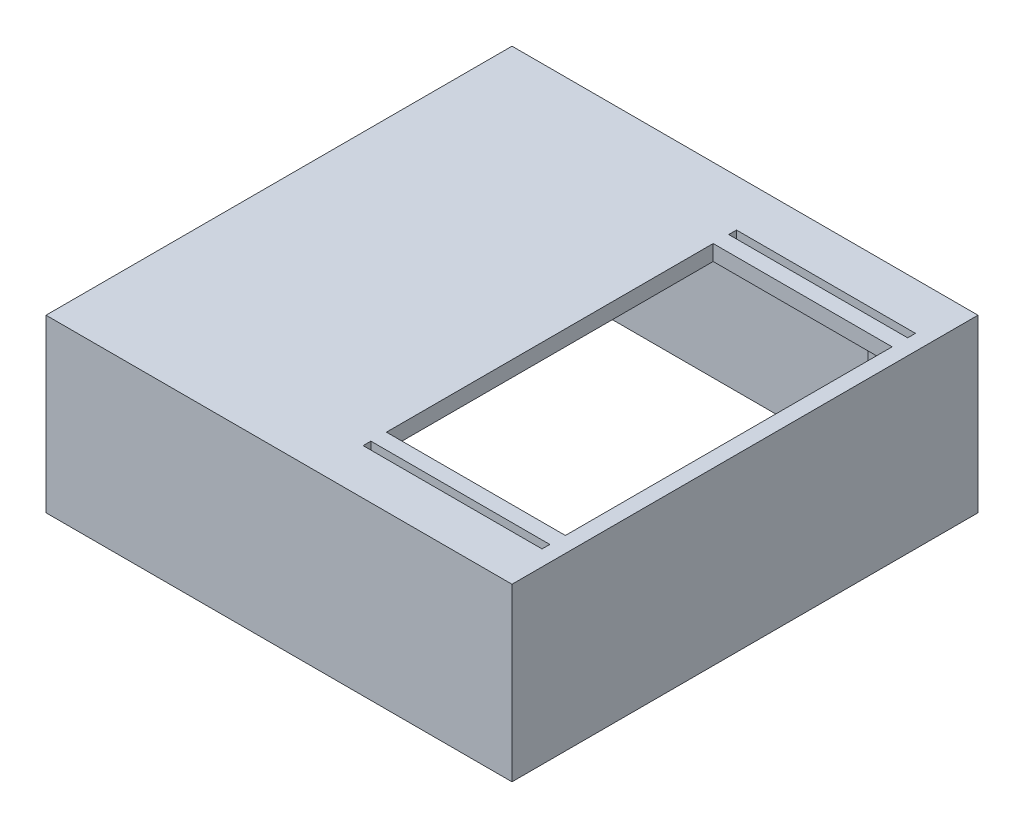
ISO-10303-21;
HEADER;
FILE_DESCRIPTION(('STEP AP214'),'2;1');
FILE_NAME('part.step','',(''),(''),'','','');
FILE_SCHEMA(('AUTOMOTIVE_DESIGN { 1 0 10303 214 1 1 1 1 }'));
ENDSEC;
DATA;
#1=APPLICATION_CONTEXT('core data for automotive mechanical design processes');
#2=APPLICATION_PROTOCOL_DEFINITION('international standard','automotive_design',2000,#1);
#3=PRODUCT_CONTEXT('',#1,'mechanical');
#4=PRODUCT('Part','Part','',(#3));
#5=PRODUCT_RELATED_PRODUCT_CATEGORY('part','',(#4));
#6=PRODUCT_DEFINITION_FORMATION('','',#4);
#7=PRODUCT_DEFINITION_CONTEXT('part definition',#1,'design');
#8=PRODUCT_DEFINITION('design','',#6,#7);
#9=PRODUCT_DEFINITION_SHAPE('','',#8);
#10=(LENGTH_UNIT() NAMED_UNIT(*) SI_UNIT(.MILLI.,.METRE.));
#11=(NAMED_UNIT(*) PLANE_ANGLE_UNIT() SI_UNIT($,.RADIAN.));
#12=(NAMED_UNIT(*) SI_UNIT($,.STERADIAN.) SOLID_ANGLE_UNIT());
#13=UNCERTAINTY_MEASURE_WITH_UNIT(LENGTH_MEASURE(1.E-05),#10,'distance_accuracy_value','');
#14=(GEOMETRIC_REPRESENTATION_CONTEXT(3) GLOBAL_UNCERTAINTY_ASSIGNED_CONTEXT((#13)) GLOBAL_UNIT_ASSIGNED_CONTEXT((#10,
#11,#12)) REPRESENTATION_CONTEXT('',''));
#15=CARTESIAN_POINT('',(0.,0.,0.));
#16=DIRECTION('',(0.,0.,1.));
#17=DIRECTION('',(1.,0.,0.));
#18=AXIS2_PLACEMENT_3D('',#15,#16,#17);
#19=CARTESIAN_POINT('',(0.,22.,0.));
#20=DIRECTION('',(0.,1.,0.));
#21=DIRECTION('',(0.,0.,1.));
#22=AXIS2_PLACEMENT_3D('',#19,#20,#21);
#23=PLANE('',#22);
#24=DIRECTION('',(1.,0.,0.));
#25=VECTOR('',#24,1.);
#26=CARTESIAN_POINT('',(0.,22.,29.9511965323931));
#27=LINE('',#26,#25);
#28=CARTESIAN_POINT('',(-29.9511965323931,22.,29.9512034676069));
#29=VERTEX_POINT('',#28);
#30=CARTESIAN_POINT('',(29.9511965323931,22.,29.9511965323931));
#31=VERTEX_POINT('',#30);
#32=EDGE_CURVE('E63',#29,#31,#27,.T.);
#33=ORIENTED_EDGE('',*,*,#32,.T.);
#34=DIRECTION('',(0.,0.,-1.));
#35=VECTOR('',#34,1.);
#36=CARTESIAN_POINT('',(29.9511965323931,22.,0.));
#37=LINE('',#36,#35);
#38=CARTESIAN_POINT('',(29.9511965323931,22.,-29.9511965323931));
#39=VERTEX_POINT('',#38);
#40=EDGE_CURVE('E354',#31,#39,#37,.T.);
#41=ORIENTED_EDGE('',*,*,#40,.T.);
#42=DIRECTION('',(-1.,0.,0.));
#43=VECTOR('',#42,1.);
#44=CARTESIAN_POINT('',(0.,22.,-29.9511965323931));
#45=LINE('',#44,#43);
#46=CARTESIAN_POINT('',(-29.9511965323931,22.,-29.9511965323931));
#47=VERTEX_POINT('',#46);
#48=EDGE_CURVE('E279',#39,#47,#45,.T.);
#49=ORIENTED_EDGE('',*,*,#48,.T.);
#50=DIRECTION('',(0.,0.,1.));
#51=VECTOR('',#50,1.);
#52=CARTESIAN_POINT('',(-29.9511965323931,22.,-29.9511965323931));
#53=LINE('',#52,#51);
#54=EDGE_CURVE('E265',#47,#29,#53,.T.);
#55=ORIENTED_EDGE('',*,*,#54,.T.);
#56=EDGE_LOOP('',(#33,#41,#49,#55));
#57=FACE_BOUND('',#56,.T.);
#58=DIRECTION('',(1.,0.,0.));
#59=VECTOR('',#58,1.);
#60=CARTESIAN_POINT('',(0.,22.,-23.909588201702));
#61=LINE('',#60,#59);
#62=CARTESIAN_POINT('',(4.95119653239312,22.,-23.909588201702));
#63=VERTEX_POINT('',#62);
#64=CARTESIAN_POINT('',(27.9511965323931,22.,-23.909588201702));
#65=VERTEX_POINT('',#64);
#66=EDGE_CURVE('E285',#63,#65,#61,.T.);
#67=ORIENTED_EDGE('',*,*,#66,.T.);
#68=DIRECTION('',(0.,0.,1.));
#69=VECTOR('',#68,1.);
#70=CARTESIAN_POINT('',(27.9511965323931,22.,0.));
#71=LINE('',#70,#69);
#72=CARTESIAN_POINT('',(27.9511965323931,22.,-22.909588201702));
#73=VERTEX_POINT('',#72);
#74=EDGE_CURVE('E85',#65,#73,#71,.T.);
#75=ORIENTED_EDGE('',*,*,#74,.T.);
#76=DIRECTION('',(1.,0.,0.));
#77=VECTOR('',#76,1.);
#78=CARTESIAN_POINT('',(0.,22.,-22.909588201702));
#79=LINE('',#78,#77);
#80=CARTESIAN_POINT('',(4.95119653239312,22.,-22.909588201702));
#81=VERTEX_POINT('',#80);
#82=EDGE_CURVE('E296',#81,#73,#79,.T.);
#83=ORIENTED_EDGE('',*,*,#82,.F.);
#84=DIRECTION('',(0.,0.,-1.));
#85=VECTOR('',#84,1.);
#86=CARTESIAN_POINT('',(4.95119653239312,22.,0.));
#87=LINE('',#86,#85);
#88=EDGE_CURVE('E308',#81,#63,#87,.T.);
#89=ORIENTED_EDGE('',*,*,#88,.T.);
#90=EDGE_LOOP('',(#67,#75,#83,#89));
#91=FACE_BOUND('',#90,.T.);
#92=DIRECTION('',(1.,0.,0.));
#93=VECTOR('',#92,1.);
#94=CARTESIAN_POINT('',(0.,22.,24.090411798298));
#95=LINE('',#94,#93);
#96=CARTESIAN_POINT('',(4.95119653239312,22.,24.090411798298));
#97=VERTEX_POINT('',#96);
#98=CARTESIAN_POINT('',(27.9511965323931,22.,24.090411798298));
#99=VERTEX_POINT('',#98);
#100=EDGE_CURVE('E315',#97,#99,#95,.T.);
#101=ORIENTED_EDGE('',*,*,#100,.F.);
#102=DIRECTION('',(0.,0.,1.));
#103=VECTOR('',#102,1.);
#104=CARTESIAN_POINT('',(4.95119653239312,22.,0.));
#105=LINE('',#104,#103);
#106=CARTESIAN_POINT('',(4.95119653239312,22.,23.090411798298));
#107=VERTEX_POINT('',#106);
#108=EDGE_CURVE('E342',#107,#97,#105,.T.);
#109=ORIENTED_EDGE('',*,*,#108,.F.);
#110=DIRECTION('',(1.,0.,0.));
#111=VECTOR('',#110,1.);
#112=CARTESIAN_POINT('',(0.,22.,23.090411798298));
#113=LINE('',#112,#111);
#114=CARTESIAN_POINT('',(27.9511965323931,22.,23.090411798298));
#115=VERTEX_POINT('',#114);
#116=EDGE_CURVE('E339',#107,#115,#113,.T.);
#117=ORIENTED_EDGE('',*,*,#116,.T.);
#118=DIRECTION('',(0.,0.,-1.));
#119=VECTOR('',#118,1.);
#120=CARTESIAN_POINT('',(27.9511965323931,22.,0.));
#121=LINE('',#120,#119);
#122=EDGE_CURVE('E336',#99,#115,#121,.T.);
#123=ORIENTED_EDGE('',*,*,#122,.F.);
#124=EDGE_LOOP('',(#101,#109,#117,#123));
#125=FACE_BOUND('',#124,.T.);
#126=DIRECTION('',(1.,0.,0.));
#127=VECTOR('',#126,1.);
#128=CARTESIAN_POINT('',(0.,22.,-20.909588201702));
#129=LINE('',#128,#127);
#130=CARTESIAN_POINT('',(4.95119653239312,22.,-20.909588201702));
#131=VERTEX_POINT('',#130);
#132=CARTESIAN_POINT('',(27.9511965323931,22.,-20.909588201702));
#133=VERTEX_POINT('',#132);
#134=EDGE_CURVE('E278',#131,#133,#129,.T.);
#135=ORIENTED_EDGE('',*,*,#134,.T.);
#136=DIRECTION('',(0.,0.,1.));
#137=VECTOR('',#136,1.);
#138=CARTESIAN_POINT('',(27.9511965323931,22.,0.));
#139=LINE('',#138,#137);
#140=CARTESIAN_POINT('',(27.9511965323931,22.,21.090411798298));
#141=VERTEX_POINT('',#140);
#142=EDGE_CURVE('E361',#133,#141,#139,.T.);
#143=ORIENTED_EDGE('',*,*,#142,.T.);
#144=DIRECTION('',(1.,0.,0.));
#145=VECTOR('',#144,1.);
#146=CARTESIAN_POINT('',(0.,22.,21.090411798298));
#147=LINE('',#146,#145);
#148=CARTESIAN_POINT('',(4.95119653239312,22.,21.090411798298));
#149=VERTEX_POINT('',#148);
#150=EDGE_CURVE('E363',#149,#141,#147,.T.);
#151=ORIENTED_EDGE('',*,*,#150,.F.);
#152=DIRECTION('',(0.,0.,1.));
#153=VECTOR('',#152,1.);
#154=CARTESIAN_POINT('',(4.95119653239312,22.,0.));
#155=LINE('',#154,#153);
#156=EDGE_CURVE('E366',#131,#149,#155,.T.);
#157=ORIENTED_EDGE('',*,*,#156,.F.);
#158=EDGE_LOOP('',(#135,#143,#151,#157));
#159=FACE_BOUND('',#158,.T.);
#160=ADVANCED_FACE('F59',(#57,#91,#125,#159),#23,.T.);
#161=CARTESIAN_POINT('',(0.,20.,-29.9511965323931));
#162=DIRECTION('',(0.,0.,-1.));
#163=DIRECTION('',(-1.,0.,0.));
#164=AXIS2_PLACEMENT_3D('',#161,#162,#163);
#165=PLANE('',#164);
#166=DIRECTION('',(0.,-1.,0.));
#167=VECTOR('',#166,1.);
#168=CARTESIAN_POINT('',(-29.9511965323931,20.,-29.9511965323931));
#169=LINE('',#168,#167);
#170=CARTESIAN_POINT('',(-29.9511965323931,0.,-29.9511965323931));
#171=VERTEX_POINT('',#170);
#172=EDGE_CURVE('E270',#47,#171,#169,.T.);
#173=ORIENTED_EDGE('',*,*,#172,.F.);
#174=ORIENTED_EDGE('',*,*,#48,.F.);
#175=DIRECTION('',(0.,-1.,0.));
#176=VECTOR('',#175,1.);
#177=CARTESIAN_POINT('',(29.9511965323931,20.,-29.9511965323931));
#178=LINE('',#177,#176);
#179=CARTESIAN_POINT('',(29.9511965323931,0.,-29.9511965323931));
#180=VERTEX_POINT('',#179);
#181=EDGE_CURVE('E425',#39,#180,#178,.T.);
#182=ORIENTED_EDGE('',*,*,#181,.T.);
#183=DIRECTION('',(1.,0.,0.));
#184=VECTOR('',#183,1.);
#185=CARTESIAN_POINT('',(0.,0.,-29.9511965323931));
#186=LINE('',#185,#184);
#187=EDGE_CURVE('E453',#171,#180,#186,.T.);
#188=ORIENTED_EDGE('',*,*,#187,.F.);
#189=EDGE_LOOP('',(#173,#174,#182,#188));
#190=FACE_BOUND('',#189,.T.);
#191=ADVANCED_FACE('F551',(#190),#165,.T.);
#192=CARTESIAN_POINT('',(-29.9511965323931,20.,0.));
#193=DIRECTION('',(1.,0.,0.));
#194=DIRECTION('',(0.,0.,-1.));
#195=AXIS2_PLACEMENT_3D('',#192,#193,#194);
#196=PLANE('',#195);
#197=DIRECTION('',(0.,0.,1.));
#198=VECTOR('',#197,1.);
#199=CARTESIAN_POINT('',(-29.9511965323931,0.,0.));
#200=LINE('',#199,#198);
#201=CARTESIAN_POINT('',(-29.9511965323931,0.,29.9511965323931));
#202=VERTEX_POINT('',#201);
#203=EDGE_CURVE('E267',#171,#202,#200,.T.);
#204=ORIENTED_EDGE('',*,*,#203,.T.);
#205=DIRECTION('',(0.,-1.,0.));
#206=VECTOR('',#205,1.);
#207=CARTESIAN_POINT('',(-29.9511965323931,20.,29.9511965323931));
#208=LINE('',#207,#206);
#209=EDGE_CURVE('E261',#29,#202,#208,.T.);
#210=ORIENTED_EDGE('',*,*,#209,.F.);
#211=ORIENTED_EDGE('',*,*,#54,.F.);
#212=ORIENTED_EDGE('',*,*,#172,.T.);
#213=EDGE_LOOP('',(#204,#210,#211,#212));
#214=FACE_BOUND('',#213,.T.);
#215=ADVANCED_FACE('F263',(#214),#196,.F.);
#216=CARTESIAN_POINT('',(0.,20.,29.9511965323931));
#217=DIRECTION('',(0.,0.,-1.));
#218=DIRECTION('',(-1.,0.,0.));
#219=AXIS2_PLACEMENT_3D('',#216,#217,#218);
#220=PLANE('',#219);
#221=DIRECTION('',(0.,-1.,0.));
#222=VECTOR('',#221,1.);
#223=CARTESIAN_POINT('',(29.9511965323931,20.,29.9511965323931));
#224=LINE('',#223,#222);
#225=CARTESIAN_POINT('',(29.9511965323931,0.,29.9511965323931));
#226=VERTEX_POINT('',#225);
#227=EDGE_CURVE('E271',#31,#226,#224,.T.);
#228=ORIENTED_EDGE('',*,*,#227,.F.);
#229=ORIENTED_EDGE('',*,*,#32,.F.);
#230=ORIENTED_EDGE('',*,*,#209,.T.);
#231=DIRECTION('',(1.,0.,0.));
#232=VECTOR('',#231,1.);
#233=CARTESIAN_POINT('',(0.,0.,29.9511965323931));
#234=LINE('',#233,#232);
#235=EDGE_CURVE('E381',#202,#226,#234,.T.);
#236=ORIENTED_EDGE('',*,*,#235,.T.);
#237=EDGE_LOOP('',(#228,#229,#230,#236));
#238=FACE_BOUND('',#237,.T.);
#239=ADVANCED_FACE('F274',(#238),#220,.F.);
#240=CARTESIAN_POINT('',(29.9511965323931,20.,0.));
#241=DIRECTION('',(1.,0.,0.));
#242=DIRECTION('',(0.,0.,-1.));
#243=AXIS2_PLACEMENT_3D('',#240,#241,#242);
#244=PLANE('',#243);
#245=DIRECTION('',(0.,0.,1.));
#246=VECTOR('',#245,1.);
#247=CARTESIAN_POINT('',(29.9511965323931,0.,0.));
#248=LINE('',#247,#246);
#249=EDGE_CURVE('E456',#180,#226,#248,.T.);
#250=ORIENTED_EDGE('',*,*,#249,.F.);
#251=ORIENTED_EDGE('',*,*,#181,.F.);
#252=ORIENTED_EDGE('',*,*,#40,.F.);
#253=ORIENTED_EDGE('',*,*,#227,.T.);
#254=EDGE_LOOP('',(#250,#251,#252,#253));
#255=FACE_BOUND('',#254,.T.);
#256=ADVANCED_FACE('F580',(#255),#244,.T.);
#257=CARTESIAN_POINT('',(0.,20.,-22.9511965323931));
#258=DIRECTION('',(0.,0.,-1.));
#259=DIRECTION('',(-1.,0.,0.));
#260=AXIS2_PLACEMENT_3D('',#257,#258,#259);
#261=PLANE('',#260);
#262=DIRECTION('',(1.,0.,0.));
#263=VECTOR('',#262,1.);
#264=CARTESIAN_POINT('',(0.,0.,-22.9511965323931));
#265=LINE('',#264,#263);
#266=CARTESIAN_POINT('',(-27.9511965323931,0.,-22.9511965323931));
#267=VERTEX_POINT('',#266);
#268=CARTESIAN_POINT('',(-22.9511965323931,0.,-22.9511965323931));
#269=VERTEX_POINT('',#268);
#270=EDGE_CURVE('E480',#267,#269,#265,.T.);
#271=ORIENTED_EDGE('',*,*,#270,.T.);
#272=DIRECTION('',(0.,-1.,0.));
#273=VECTOR('',#272,1.);
#274=CARTESIAN_POINT('',(-22.9511965323931,20.,-22.9511965323931));
#275=LINE('',#274,#273);
#276=CARTESIAN_POINT('',(-22.9511965323931,20.,-22.9511965323931));
#277=VERTEX_POINT('',#276);
#278=EDGE_CURVE('E428',#277,#269,#275,.T.);
#279=ORIENTED_EDGE('',*,*,#278,.F.);
#280=DIRECTION('',(1.,0.,0.));
#281=VECTOR('',#280,1.);
#282=CARTESIAN_POINT('',(0.,20.,-22.9511965323931));
#283=LINE('',#282,#281);
#284=CARTESIAN_POINT('',(-27.9511965323931,20.,-22.9511965323931));
#285=VERTEX_POINT('',#284);
#286=EDGE_CURVE('E380',#285,#277,#283,.T.);
#287=ORIENTED_EDGE('',*,*,#286,.F.);
#288=DIRECTION('',(0.,-1.,0.));
#289=VECTOR('',#288,1.);
#290=CARTESIAN_POINT('',(-27.9511965323931,20.,-22.9511965323931));
#291=LINE('',#290,#289);
#292=EDGE_CURVE('E426',#285,#267,#291,.T.);
#293=ORIENTED_EDGE('',*,*,#292,.T.);
#294=EDGE_LOOP('',(#271,#279,#287,#293));
#295=FACE_BOUND('',#294,.T.);
#296=ADVANCED_FACE('F585',(#295),#261,.F.);
#297=CARTESIAN_POINT('',(-22.9511965323931,20.,0.));
#298=DIRECTION('',(1.,0.,0.));
#299=DIRECTION('',(0.,0.,-1.));
#300=AXIS2_PLACEMENT_3D('',#297,#298,#299);
#301=PLANE('',#300);
#302=DIRECTION('',(0.,0.,1.));
#303=VECTOR('',#302,1.);
#304=CARTESIAN_POINT('',(-22.9511965323931,0.,0.));
#305=LINE('',#304,#303);
#306=CARTESIAN_POINT('',(-22.9511965323931,0.,-27.9511965323931));
#307=VERTEX_POINT('',#306);
#308=EDGE_CURVE('E477',#307,#269,#305,.T.);
#309=ORIENTED_EDGE('',*,*,#308,.F.);
#310=DIRECTION('',(0.,-1.,0.));
#311=VECTOR('',#310,1.);
#312=CARTESIAN_POINT('',(-22.9511965323931,20.,-27.9511965323931));
#313=LINE('',#312,#311);
#314=CARTESIAN_POINT('',(-22.9511965323931,20.,-27.9511965323931));
#315=VERTEX_POINT('',#314);
#316=EDGE_CURVE('E430',#315,#307,#313,.T.);
#317=ORIENTED_EDGE('',*,*,#316,.F.);
#318=DIRECTION('',(0.,0.,1.));
#319=VECTOR('',#318,1.);
#320=CARTESIAN_POINT('',(-22.9511965323931,20.,0.));
#321=LINE('',#320,#319);
#322=EDGE_CURVE('E384',#315,#277,#321,.T.);
#323=ORIENTED_EDGE('',*,*,#322,.T.);
#324=ORIENTED_EDGE('',*,*,#278,.T.);
#325=EDGE_LOOP('',(#309,#317,#323,#324));
#326=FACE_BOUND('',#325,.T.);
#327=ADVANCED_FACE('F608',(#326),#301,.T.);
#328=CARTESIAN_POINT('',(0.,20.,-27.9511965323931));
#329=DIRECTION('',(0.,0.,-1.));
#330=DIRECTION('',(-1.,0.,0.));
#331=AXIS2_PLACEMENT_3D('',#328,#329,#330);
#332=PLANE('',#331);
#333=DIRECTION('',(1.,0.,0.));
#334=VECTOR('',#333,1.);
#335=CARTESIAN_POINT('',(0.,0.,-27.9511965323931));
#336=LINE('',#335,#334);
#337=CARTESIAN_POINT('',(22.9511965323931,0.,-27.9511965323931));
#338=VERTEX_POINT('',#337);
#339=EDGE_CURVE('E475',#307,#338,#336,.T.);
#340=ORIENTED_EDGE('',*,*,#339,.T.);
#341=DIRECTION('',(0.,-1.,0.));
#342=VECTOR('',#341,1.);
#343=CARTESIAN_POINT('',(22.9511965323931,20.,-27.9511965323931));
#344=LINE('',#343,#342);
#345=CARTESIAN_POINT('',(22.9511965323931,20.,-27.9511965323931));
#346=VERTEX_POINT('',#345);
#347=EDGE_CURVE('E432',#346,#338,#344,.T.);
#348=ORIENTED_EDGE('',*,*,#347,.F.);
#349=DIRECTION('',(1.,0.,0.));
#350=VECTOR('',#349,1.);
#351=CARTESIAN_POINT('',(0.,20.,-27.9511965323931));
#352=LINE('',#351,#350);
#353=EDGE_CURVE('E387',#315,#346,#352,.T.);
#354=ORIENTED_EDGE('',*,*,#353,.F.);
#355=ORIENTED_EDGE('',*,*,#316,.T.);
#356=EDGE_LOOP('',(#340,#348,#354,#355));
#357=FACE_BOUND('',#356,.T.);
#358=ADVANCED_FACE('F604',(#357),#332,.F.);
#359=CARTESIAN_POINT('',(22.9511965323931,20.,0.));
#360=DIRECTION('',(1.,0.,0.));
#361=DIRECTION('',(0.,0.,-1.));
#362=AXIS2_PLACEMENT_3D('',#359,#360,#361);
#363=PLANE('',#362);
#364=DIRECTION('',(0.,0.,1.));
#365=VECTOR('',#364,1.);
#366=CARTESIAN_POINT('',(22.9511965323931,0.,0.));
#367=LINE('',#366,#365);
#368=CARTESIAN_POINT('',(22.9511965323931,0.,-22.7937986002485));
#369=VERTEX_POINT('',#368);
#370=EDGE_CURVE('E472',#338,#369,#367,.T.);
#371=ORIENTED_EDGE('',*,*,#370,.T.);
#372=DIRECTION('',(0.,-1.,0.));
#373=VECTOR('',#372,1.);
#374=CARTESIAN_POINT('',(22.9511965323931,20.,-22.7937986002485));
#375=LINE('',#374,#373);
#376=CARTESIAN_POINT('',(22.9511965323931,20.,-22.7937986002485));
#377=VERTEX_POINT('',#376);
#378=EDGE_CURVE('E435',#377,#369,#375,.T.);
#379=ORIENTED_EDGE('',*,*,#378,.F.);
#380=DIRECTION('',(0.,0.,1.));
#381=VECTOR('',#380,1.);
#382=CARTESIAN_POINT('',(22.9511965323931,20.,0.));
#383=LINE('',#382,#381);
#384=CARTESIAN_POINT('',(22.9511965323931,20.,-22.909588201702));
#385=VERTEX_POINT('',#384);
#386=EDGE_CURVE('E389',#385,#377,#383,.T.);
#387=ORIENTED_EDGE('',*,*,#386,.F.);
#388=CARTESIAN_POINT('',(22.9511965323931,20.,-23.909588201702));
#389=VERTEX_POINT('',#388);
#390=EDGE_CURVE('E394',#389,#385,#383,.T.);
#391=ORIENTED_EDGE('',*,*,#390,.F.);
#392=EDGE_CURVE('E390',#346,#389,#383,.T.);
#393=ORIENTED_EDGE('',*,*,#392,.F.);
#394=ORIENTED_EDGE('',*,*,#347,.T.);
#395=EDGE_LOOP('',(#371,#379,#387,#391,#393,#394));
#396=FACE_BOUND('',#395,.T.);
#397=ADVANCED_FACE('F600',(#396),#363,.F.);
#398=CARTESIAN_POINT('',(0.,20.,-22.7937986002485));
#399=DIRECTION('',(0.,0.,1.));
#400=DIRECTION('',(1.,0.,0.));
#401=AXIS2_PLACEMENT_3D('',#398,#399,#400);
#402=PLANE('',#401);
#403=DIRECTION('',(-1.,0.,0.));
#404=VECTOR('',#403,1.);
#405=CARTESIAN_POINT('',(0.,0.,-22.7937986002485));
#406=LINE('',#405,#404);
#407=CARTESIAN_POINT('',(27.9511965323931,0.,-22.7937986002485));
#408=VERTEX_POINT('',#407);
#409=EDGE_CURVE('E469',#408,#369,#406,.T.);
#410=ORIENTED_EDGE('',*,*,#409,.F.);
#411=DIRECTION('',(0.,-1.,0.));
#412=VECTOR('',#411,1.);
#413=CARTESIAN_POINT('',(27.9511965323931,20.,-22.7937986002485));
#414=LINE('',#413,#412);
#415=CARTESIAN_POINT('',(27.9511965323931,20.,-22.7937986002485));
#416=VERTEX_POINT('',#415);
#417=EDGE_CURVE('E437',#416,#408,#414,.T.);
#418=ORIENTED_EDGE('',*,*,#417,.F.);
#419=DIRECTION('',(-1.,0.,0.));
#420=VECTOR('',#419,1.);
#421=CARTESIAN_POINT('',(0.,20.,-22.7937986002485));
#422=LINE('',#421,#420);
#423=EDGE_CURVE('E393',#416,#377,#422,.T.);
#424=ORIENTED_EDGE('',*,*,#423,.T.);
#425=ORIENTED_EDGE('',*,*,#378,.T.);
#426=EDGE_LOOP('',(#410,#418,#424,#425));
#427=FACE_BOUND('',#426,.T.);
#428=ADVANCED_FACE('F596',(#427),#402,.T.);
#429=CARTESIAN_POINT('',(27.9511965323931,20.,0.));
#430=DIRECTION('',(1.,0.,0.));
#431=DIRECTION('',(0.,0.,-1.));
#432=AXIS2_PLACEMENT_3D('',#429,#430,#431);
#433=PLANE('',#432);
#434=DIRECTION('',(0.,0.,1.));
#435=VECTOR('',#434,1.);
#436=CARTESIAN_POINT('',(27.9511965323931,0.,0.));
#437=LINE('',#436,#435);
#438=CARTESIAN_POINT('',(27.9511965323931,0.,22.9746221968444));
#439=VERTEX_POINT('',#438);
#440=EDGE_CURVE('E467',#408,#439,#437,.T.);
#441=ORIENTED_EDGE('',*,*,#440,.T.);
#442=DIRECTION('',(0.,-1.,0.));
#443=VECTOR('',#442,1.);
#444=CARTESIAN_POINT('',(27.9511965323931,20.,22.9746221968444));
#445=LINE('',#444,#443);
#446=CARTESIAN_POINT('',(27.9511965323931,20.,22.9746221968444));
#447=VERTEX_POINT('',#446);
#448=EDGE_CURVE('E439',#447,#439,#445,.T.);
#449=ORIENTED_EDGE('',*,*,#448,.F.);
#450=DIRECTION('',(0.,0.,1.));
#451=VECTOR('',#450,1.);
#452=CARTESIAN_POINT('',(27.9511965323931,20.,0.));
#453=LINE('',#452,#451);
#454=CARTESIAN_POINT('',(27.9511965323931,20.,21.090411798298));
#455=VERTEX_POINT('',#454);
#456=EDGE_CURVE('E397',#455,#447,#453,.T.);
#457=ORIENTED_EDGE('',*,*,#456,.F.);
#458=DIRECTION('',(0.,-1.,0.));
#459=VECTOR('',#458,1.);
#460=CARTESIAN_POINT('',(27.9511965323931,22.,21.090411798298));
#461=LINE('',#460,#459);
#462=EDGE_CURVE('E376',#141,#455,#461,.T.);
#463=ORIENTED_EDGE('',*,*,#462,.F.);
#464=ORIENTED_EDGE('',*,*,#142,.F.);
#465=DIRECTION('',(0.,-1.,0.));
#466=VECTOR('',#465,1.);
#467=CARTESIAN_POINT('',(27.9511965323931,22.,-20.909588201702));
#468=LINE('',#467,#466);
#469=CARTESIAN_POINT('',(27.9511965323931,20.,-20.909588201702));
#470=VERTEX_POINT('',#469);
#471=EDGE_CURVE('E419',#133,#470,#468,.T.);
#472=ORIENTED_EDGE('',*,*,#471,.T.);
#473=EDGE_CURVE('E406',#416,#470,#453,.T.);
#474=ORIENTED_EDGE('',*,*,#473,.F.);
#475=ORIENTED_EDGE('',*,*,#417,.T.);
#476=EDGE_LOOP('',(#441,#449,#457,#463,#464,#472,#474,#475));
#477=FACE_BOUND('',#476,.T.);
#478=ADVANCED_FACE('F593',(#477),#433,.F.);
#479=CARTESIAN_POINT('',(0.,20.,22.9746221968444));
#480=DIRECTION('',(0.,0.,1.));
#481=DIRECTION('',(1.,0.,0.));
#482=AXIS2_PLACEMENT_3D('',#479,#480,#481);
#483=PLANE('',#482);
#484=DIRECTION('',(-1.,0.,0.));
#485=VECTOR('',#484,1.);
#486=CARTESIAN_POINT('',(0.,0.,22.9746221968444));
#487=LINE('',#486,#485);
#488=CARTESIAN_POINT('',(22.9746221968444,0.,22.9746221968444));
#489=VERTEX_POINT('',#488);
#490=EDGE_CURVE('E464',#439,#489,#487,.T.);
#491=ORIENTED_EDGE('',*,*,#490,.T.);
#492=DIRECTION('',(0.,-1.,0.));
#493=VECTOR('',#492,1.);
#494=CARTESIAN_POINT('',(22.9746221968444,20.,22.9746221968444));
#495=LINE('',#494,#493);
#496=CARTESIAN_POINT('',(22.9746221968444,20.,22.9746221968444));
#497=VERTEX_POINT('',#496);
#498=EDGE_CURVE('E442',#497,#489,#495,.T.);
#499=ORIENTED_EDGE('',*,*,#498,.F.);
#500=DIRECTION('',(-1.,0.,0.));
#501=VECTOR('',#500,1.);
#502=CARTESIAN_POINT('',(0.,20.,22.9746221968444));
#503=LINE('',#502,#501);
#504=EDGE_CURVE('E400',#447,#497,#503,.T.);
#505=ORIENTED_EDGE('',*,*,#504,.F.);
#506=ORIENTED_EDGE('',*,*,#448,.T.);
#507=EDGE_LOOP('',(#491,#499,#505,#506));
#508=FACE_BOUND('',#507,.T.);
#509=ADVANCED_FACE('F503',(#508),#483,.F.);
#510=CARTESIAN_POINT('',(22.9746221968444,20.,0.));
#511=DIRECTION('',(-1.,0.,0.));
#512=DIRECTION('',(0.,0.,1.));
#513=AXIS2_PLACEMENT_3D('',#510,#511,#512);
#514=PLANE('',#513);
#515=DIRECTION('',(0.,0.,-1.));
#516=VECTOR('',#515,1.);
#517=CARTESIAN_POINT('',(22.9746221968444,0.,0.));
#518=LINE('',#517,#516);
#519=CARTESIAN_POINT('',(22.9746221968444,0.,27.9511965323931));
#520=VERTEX_POINT('',#519);
#521=EDGE_CURVE('E461',#520,#489,#518,.T.);
#522=ORIENTED_EDGE('',*,*,#521,.F.);
#523=DIRECTION('',(0.,-1.,0.));
#524=VECTOR('',#523,1.);
#525=CARTESIAN_POINT('',(22.9746221968444,20.,27.9511965323931));
#526=LINE('',#525,#524);
#527=CARTESIAN_POINT('',(22.9746221968444,20.,27.9511965323931));
#528=VERTEX_POINT('',#527);
#529=EDGE_CURVE('E444',#528,#520,#526,.T.);
#530=ORIENTED_EDGE('',*,*,#529,.F.);
#531=DIRECTION('',(0.,0.,-1.));
#532=VECTOR('',#531,1.);
#533=CARTESIAN_POINT('',(22.9746221968444,20.,0.));
#534=LINE('',#533,#532);
#535=CARTESIAN_POINT('',(22.9746221968444,20.,24.090411798298));
#536=VERTEX_POINT('',#535);
#537=EDGE_CURVE('E485',#528,#536,#534,.T.);
#538=ORIENTED_EDGE('',*,*,#537,.T.);
#539=CARTESIAN_POINT('',(22.9746221968444,20.,23.090411798298));
#540=VERTEX_POINT('',#539);
#541=EDGE_CURVE('E487',#536,#540,#534,.T.);
#542=ORIENTED_EDGE('',*,*,#541,.T.);
#543=EDGE_CURVE('E488',#540,#497,#534,.T.);
#544=ORIENTED_EDGE('',*,*,#543,.T.);
#545=ORIENTED_EDGE('',*,*,#498,.T.);
#546=EDGE_LOOP('',(#522,#530,#538,#542,#544,#545));
#547=FACE_BOUND('',#546,.T.);
#548=ADVANCED_FACE('F506',(#547),#514,.T.);
#549=CARTESIAN_POINT('',(0.,20.,27.9511965323931));
#550=DIRECTION('',(0.,0.,-1.));
#551=DIRECTION('',(-1.,0.,0.));
#552=AXIS2_PLACEMENT_3D('',#549,#550,#551);
#553=PLANE('',#552);
#554=DIRECTION('',(1.,0.,0.));
#555=VECTOR('',#554,1.);
#556=CARTESIAN_POINT('',(0.,0.,27.9511965323931));
#557=LINE('',#556,#555);
#558=CARTESIAN_POINT('',(-22.9676135349292,0.,27.9511965323931));
#559=VERTEX_POINT('',#558);
#560=EDGE_CURVE('E459',#559,#520,#557,.T.);
#561=ORIENTED_EDGE('',*,*,#560,.F.);
#562=DIRECTION('',(0.,1.,0.));
#563=VECTOR('',#562,1.);
#564=CARTESIAN_POINT('',(-22.9676135349292,20.,27.9511965323931));
#565=LINE('',#564,#563);
#566=CARTESIAN_POINT('',(-22.9676135349292,20.,27.9511965323931));
#567=VERTEX_POINT('',#566);
#568=EDGE_CURVE('E69',#559,#567,#565,.T.);
#569=ORIENTED_EDGE('',*,*,#568,.T.);
#570=DIRECTION('',(1.,0.,0.));
#571=VECTOR('',#570,1.);
#572=CARTESIAN_POINT('',(0.,20.,27.9511965323931));
#573=LINE('',#572,#571);
#574=EDGE_CURVE('E447',#567,#528,#573,.T.);
#575=ORIENTED_EDGE('',*,*,#574,.T.);
#576=ORIENTED_EDGE('',*,*,#529,.T.);
#577=EDGE_LOOP('',(#561,#569,#575,#576));
#578=FACE_BOUND('',#577,.T.);
#579=ADVANCED_FACE('F514',(#578),#553,.T.);
#580=CARTESIAN_POINT('',(-27.9511965323931,20.,0.));
#581=DIRECTION('',(1.,0.,0.));
#582=DIRECTION('',(0.,0.,-1.));
#583=AXIS2_PLACEMENT_3D('',#580,#581,#582);
#584=PLANE('',#583);
#585=DIRECTION('',(0.,1.,0.));
#586=VECTOR('',#585,1.);
#587=CARTESIAN_POINT('',(-27.9511965323931,20.,22.9676135349292));
#588=LINE('',#587,#586);
#589=CARTESIAN_POINT('',(-27.9511965323931,0.,22.9676135349292));
#590=VERTEX_POINT('',#589);
#591=CARTESIAN_POINT('',(-27.9511965323931,20.,22.9676135349292));
#592=VERTEX_POINT('',#591);
#593=EDGE_CURVE('E12',#590,#592,#588,.T.);
#594=ORIENTED_EDGE('',*,*,#593,.F.);
#595=DIRECTION('',(0.,0.,1.));
#596=VECTOR('',#595,1.);
#597=CARTESIAN_POINT('',(-27.9511965323931,0.,0.));
#598=LINE('',#597,#596);
#599=EDGE_CURVE('E410',#267,#590,#598,.T.);
#600=ORIENTED_EDGE('',*,*,#599,.F.);
#601=ORIENTED_EDGE('',*,*,#292,.F.);
#602=DIRECTION('',(0.,0.,1.));
#603=VECTOR('',#602,1.);
#604=CARTESIAN_POINT('',(-27.9511965323931,20.,0.));
#605=LINE('',#604,#603);
#606=EDGE_CURVE('E377',#285,#592,#605,.T.);
#607=ORIENTED_EDGE('',*,*,#606,.T.);
#608=EDGE_LOOP('',(#594,#600,#601,#607));
#609=FACE_BOUND('',#608,.T.);
#610=ADVANCED_FACE('F576',(#609),#584,.T.);
#611=CARTESIAN_POINT('',(0.,0.,0.));
#612=DIRECTION('',(0.,1.,0.));
#613=DIRECTION('',(0.,0.,1.));
#614=AXIS2_PLACEMENT_3D('',#611,#612,#613);
#615=PLANE('',#614);
#616=CARTESIAN_POINT('',(-26.4594050336612,0.,26.4594050336612));
#617=DIRECTION('',(0.,-1.,0.));
#618=DIRECTION('',(0.,0.,-1.));
#619=AXIS2_PLACEMENT_3D('',#616,#617,#618);
#620=CIRCLE('',#619,1.5);
#621=CARTESIAN_POINT('',(-26.4594050336612,0.,24.9594050336612));
#622=VERTEX_POINT('',#621);
#623=EDGE_CURVE('E1074',#622,#622,#620,.T.);
#624=ORIENTED_EDGE('',*,*,#623,.F.);
#625=EDGE_LOOP('',(#624));
#626=FACE_BOUND('',#625,.T.);
#627=CARTESIAN_POINT('',(-26.4511965323931,0.,-26.4511965323931));
#628=DIRECTION('',(0.,-1.,0.));
#629=DIRECTION('',(0.,0.,-1.));
#630=AXIS2_PLACEMENT_3D('',#627,#628,#629);
#631=CIRCLE('',#630,1.5);
#632=CARTESIAN_POINT('',(-26.4511965323931,0.,-27.9511965323931));
#633=VERTEX_POINT('',#632);
#634=EDGE_CURVE('E1080',#633,#633,#631,.T.);
#635=ORIENTED_EDGE('',*,*,#634,.F.);
#636=EDGE_LOOP('',(#635));
#637=FACE_BOUND('',#636,.T.);
#638=CARTESIAN_POINT('',(26.4511965323931,0.,-26.3724975663208));
#639=DIRECTION('',(0.,-1.,0.));
#640=DIRECTION('',(0.,0.,-1.));
#641=AXIS2_PLACEMENT_3D('',#638,#639,#640);
#642=CIRCLE('',#641,1.5);
#643=CARTESIAN_POINT('',(26.4511965323931,0.,-27.8724975663208));
#644=VERTEX_POINT('',#643);
#645=EDGE_CURVE('E1086',#644,#644,#642,.T.);
#646=ORIENTED_EDGE('',*,*,#645,.F.);
#647=EDGE_LOOP('',(#646));
#648=FACE_BOUND('',#647,.T.);
#649=CARTESIAN_POINT('',(26.4629093646188,0.,26.4629093646188));
#650=DIRECTION('',(0.,-1.,0.));
#651=DIRECTION('',(0.,0.,-1.));
#652=AXIS2_PLACEMENT_3D('',#649,#650,#651);
#653=CIRCLE('',#652,1.5);
#654=CARTESIAN_POINT('',(26.4629093646188,0.,24.9629093646188));
#655=VERTEX_POINT('',#654);
#656=EDGE_CURVE('E288',#655,#655,#653,.T.);
#657=ORIENTED_EDGE('',*,*,#656,.F.);
#658=EDGE_LOOP('',(#657));
#659=FACE_BOUND('',#658,.T.);
#660=ORIENTED_EDGE('',*,*,#599,.T.);
#661=DIRECTION('',(1.,0.,0.));
#662=VECTOR('',#661,1.);
#663=CARTESIAN_POINT('',(-27.9511965323931,0.,22.9676135349292));
#664=LINE('',#663,#662);
#665=CARTESIAN_POINT('',(-22.9676135349292,0.,22.9676135349292));
#666=VERTEX_POINT('',#665);
#667=EDGE_CURVE('E412',#590,#666,#664,.T.);
#668=ORIENTED_EDGE('',*,*,#667,.T.);
#669=DIRECTION('',(0.,0.,-1.));
#670=VECTOR('',#669,1.);
#671=CARTESIAN_POINT('',(-22.9676135349292,0.,27.9511965323931));
#672=LINE('',#671,#670);
#673=EDGE_CURVE('E416',#559,#666,#672,.T.);
#674=ORIENTED_EDGE('',*,*,#673,.F.);
#675=ORIENTED_EDGE('',*,*,#560,.T.);
#676=ORIENTED_EDGE('',*,*,#521,.T.);
#677=ORIENTED_EDGE('',*,*,#490,.F.);
#678=ORIENTED_EDGE('',*,*,#440,.F.);
#679=ORIENTED_EDGE('',*,*,#409,.T.);
#680=ORIENTED_EDGE('',*,*,#370,.F.);
#681=ORIENTED_EDGE('',*,*,#339,.F.);
#682=ORIENTED_EDGE('',*,*,#308,.T.);
#683=ORIENTED_EDGE('',*,*,#270,.F.);
#684=EDGE_LOOP('',(#660,#668,#674,#675,#676,#677,#678,#679,#680,#681,#682,#683));
#685=FACE_BOUND('',#684,.T.);
#686=ORIENTED_EDGE('',*,*,#249,.T.);
#687=ORIENTED_EDGE('',*,*,#235,.F.);
#688=ORIENTED_EDGE('',*,*,#203,.F.);
#689=ORIENTED_EDGE('',*,*,#187,.T.);
#690=EDGE_LOOP('',(#686,#687,#688,#689));
#691=FACE_BOUND('',#690,.T.);
#692=ADVANCED_FACE('F508',(#626,#637,#648,#659,#685,#691),#615,.F.);
#693=CARTESIAN_POINT('',(-22.9676135349292,20.,27.9511965323931));
#694=DIRECTION('',(-1.,0.,0.));
#695=DIRECTION('',(0.,0.,1.));
#696=AXIS2_PLACEMENT_3D('',#693,#694,#695);
#697=PLANE('',#696);
#698=ORIENTED_EDGE('',*,*,#673,.T.);
#699=DIRECTION('',(0.,-1.,0.));
#700=VECTOR('',#699,1.);
#701=CARTESIAN_POINT('',(-22.9676135349292,20.,22.9676135349292));
#702=LINE('',#701,#700);
#703=CARTESIAN_POINT('',(-22.9676135349292,20.,22.9676135349292));
#704=VERTEX_POINT('',#703);
#705=EDGE_CURVE('E408',#704,#666,#702,.T.);
#706=ORIENTED_EDGE('',*,*,#705,.F.);
#707=DIRECTION('',(0.,0.,-1.));
#708=VECTOR('',#707,1.);
#709=CARTESIAN_POINT('',(-22.9676135349292,20.,27.9511965323931));
#710=LINE('',#709,#708);
#711=EDGE_CURVE('E415',#567,#704,#710,.T.);
#712=ORIENTED_EDGE('',*,*,#711,.F.);
#713=ORIENTED_EDGE('',*,*,#568,.F.);
#714=EDGE_LOOP('',(#698,#706,#712,#713));
#715=FACE_BOUND('',#714,.T.);
#716=ADVANCED_FACE('F61',(#715),#697,.F.);
#717=CARTESIAN_POINT('',(-27.9511965323931,20.,22.9676135349292));
#718=DIRECTION('',(0.,0.,-1.));
#719=DIRECTION('',(-1.,0.,0.));
#720=AXIS2_PLACEMENT_3D('',#717,#718,#719);
#721=PLANE('',#720);
#722=ORIENTED_EDGE('',*,*,#667,.F.);
#723=ORIENTED_EDGE('',*,*,#593,.T.);
#724=DIRECTION('',(1.,0.,0.));
#725=VECTOR('',#724,1.);
#726=CARTESIAN_POINT('',(-27.9511965323931,20.,22.9676135349292));
#727=LINE('',#726,#725);
#728=EDGE_CURVE('E411',#592,#704,#727,.T.);
#729=ORIENTED_EDGE('',*,*,#728,.T.);
#730=ORIENTED_EDGE('',*,*,#705,.T.);
#731=EDGE_LOOP('',(#722,#723,#729,#730));
#732=FACE_BOUND('',#731,.T.);
#733=ADVANCED_FACE('F562',(#732),#721,.T.);
#734=CARTESIAN_POINT('',(0.,20.,0.));
#735=DIRECTION('',(0.,1.,0.));
#736=DIRECTION('',(0.,0.,1.));
#737=AXIS2_PLACEMENT_3D('',#734,#735,#736);
#738=PLANE('',#737);
#739=ORIENTED_EDGE('',*,*,#353,.T.);
#740=ORIENTED_EDGE('',*,*,#392,.T.);
#741=DIRECTION('',(1.,0.,0.));
#742=VECTOR('',#741,1.);
#743=CARTESIAN_POINT('',(0.,20.,-23.909588201702));
#744=LINE('',#743,#742);
#745=CARTESIAN_POINT('',(4.95119653239312,20.,-23.909588201702));
#746=VERTEX_POINT('',#745);
#747=EDGE_CURVE('E297',#746,#389,#744,.T.);
#748=ORIENTED_EDGE('',*,*,#747,.F.);
#749=DIRECTION('',(0.,0.,-1.));
#750=VECTOR('',#749,1.);
#751=CARTESIAN_POINT('',(4.95119653239312,20.,0.));
#752=LINE('',#751,#750);
#753=CARTESIAN_POINT('',(4.95119653239312,20.,-22.909588201702));
#754=VERTEX_POINT('',#753);
#755=EDGE_CURVE('E299',#754,#746,#752,.T.);
#756=ORIENTED_EDGE('',*,*,#755,.F.);
#757=DIRECTION('',(1.,0.,0.));
#758=VECTOR('',#757,1.);
#759=CARTESIAN_POINT('',(0.,20.,-22.909588201702));
#760=LINE('',#759,#758);
#761=EDGE_CURVE('E302',#754,#385,#760,.T.);
#762=ORIENTED_EDGE('',*,*,#761,.T.);
#763=ORIENTED_EDGE('',*,*,#386,.T.);
#764=ORIENTED_EDGE('',*,*,#423,.F.);
#765=ORIENTED_EDGE('',*,*,#473,.T.);
#766=DIRECTION('',(1.,0.,0.));
#767=VECTOR('',#766,1.);
#768=CARTESIAN_POINT('',(0.,20.,-20.909588201702));
#769=LINE('',#768,#767);
#770=CARTESIAN_POINT('',(4.95119653239312,20.,-20.909588201702));
#771=VERTEX_POINT('',#770);
#772=EDGE_CURVE('E347',#771,#470,#769,.T.);
#773=ORIENTED_EDGE('',*,*,#772,.F.);
#774=DIRECTION('',(0.,0.,1.));
#775=VECTOR('',#774,1.);
#776=CARTESIAN_POINT('',(4.95119653239312,20.,0.));
#777=LINE('',#776,#775);
#778=CARTESIAN_POINT('',(4.95119653239312,20.,21.090411798298));
#779=VERTEX_POINT('',#778);
#780=EDGE_CURVE('E356',#771,#779,#777,.T.);
#781=ORIENTED_EDGE('',*,*,#780,.T.);
#782=DIRECTION('',(1.,0.,0.));
#783=VECTOR('',#782,1.);
#784=CARTESIAN_POINT('',(0.,20.,21.090411798298));
#785=LINE('',#784,#783);
#786=EDGE_CURVE('E372',#779,#455,#785,.T.);
#787=ORIENTED_EDGE('',*,*,#786,.T.);
#788=ORIENTED_EDGE('',*,*,#456,.T.);
#789=ORIENTED_EDGE('',*,*,#504,.T.);
#790=ORIENTED_EDGE('',*,*,#543,.F.);
#791=DIRECTION('',(1.,0.,0.));
#792=VECTOR('',#791,1.);
#793=CARTESIAN_POINT('',(0.,20.,23.090411798298));
#794=LINE('',#793,#792);
#795=CARTESIAN_POINT('',(4.95119653239312,20.,23.090411798298));
#796=VERTEX_POINT('',#795);
#797=EDGE_CURVE('E328',#796,#540,#794,.T.);
#798=ORIENTED_EDGE('',*,*,#797,.F.);
#799=DIRECTION('',(0.,0.,1.));
#800=VECTOR('',#799,1.);
#801=CARTESIAN_POINT('',(4.95119653239312,20.,0.));
#802=LINE('',#801,#800);
#803=CARTESIAN_POINT('',(4.95119653239312,20.,24.090411798298));
#804=VERTEX_POINT('',#803);
#805=EDGE_CURVE('E331',#796,#804,#802,.T.);
#806=ORIENTED_EDGE('',*,*,#805,.T.);
#807=DIRECTION('',(1.,0.,0.));
#808=VECTOR('',#807,1.);
#809=CARTESIAN_POINT('',(0.,20.,24.090411798298));
#810=LINE('',#809,#808);
#811=EDGE_CURVE('E320',#804,#536,#810,.T.);
#812=ORIENTED_EDGE('',*,*,#811,.T.);
#813=ORIENTED_EDGE('',*,*,#537,.F.);
#814=ORIENTED_EDGE('',*,*,#574,.F.);
#815=ORIENTED_EDGE('',*,*,#711,.T.);
#816=ORIENTED_EDGE('',*,*,#728,.F.);
#817=ORIENTED_EDGE('',*,*,#606,.F.);
#818=ORIENTED_EDGE('',*,*,#286,.T.);
#819=ORIENTED_EDGE('',*,*,#322,.F.);
#820=EDGE_LOOP('',(#739,#740,#748,#756,#762,#763,#764,#765,#773,#781,#787,#788,#789,#790,#798,
#806,#812,#813,#814,#815,#816,#817,#818,#819));
#821=FACE_BOUND('',#820,.T.);
#822=ADVANCED_FACE('F499',(#821),#738,.F.);
#823=CARTESIAN_POINT('',(0.,22.,-20.909588201702));
#824=DIRECTION('',(0.,0.,-1.));
#825=DIRECTION('',(-1.,0.,0.));
#826=AXIS2_PLACEMENT_3D('',#823,#824,#825);
#827=PLANE('',#826);
#828=ORIENTED_EDGE('',*,*,#772,.T.);
#829=ORIENTED_EDGE('',*,*,#471,.F.);
#830=ORIENTED_EDGE('',*,*,#134,.F.);
#831=DIRECTION('',(0.,-1.,0.));
#832=VECTOR('',#831,1.);
#833=CARTESIAN_POINT('',(4.95119653239312,22.,-20.909588201702));
#834=LINE('',#833,#832);
#835=EDGE_CURVE('E369',#131,#771,#834,.T.);
#836=ORIENTED_EDGE('',*,*,#835,.T.);
#837=EDGE_LOOP('',(#828,#829,#830,#836));
#838=FACE_BOUND('',#837,.T.);
#839=ADVANCED_FACE('F561',(#838),#827,.F.);
#840=CARTESIAN_POINT('',(0.,22.,21.090411798298));
#841=DIRECTION('',(0.,0.,-1.));
#842=DIRECTION('',(-1.,0.,0.));
#843=AXIS2_PLACEMENT_3D('',#840,#841,#842);
#844=PLANE('',#843);
#845=ORIENTED_EDGE('',*,*,#786,.F.);
#846=DIRECTION('',(0.,-1.,0.));
#847=VECTOR('',#846,1.);
#848=CARTESIAN_POINT('',(4.95119653239312,22.,21.090411798298));
#849=LINE('',#848,#847);
#850=EDGE_CURVE('E374',#149,#779,#849,.T.);
#851=ORIENTED_EDGE('',*,*,#850,.F.);
#852=ORIENTED_EDGE('',*,*,#150,.T.);
#853=ORIENTED_EDGE('',*,*,#462,.T.);
#854=EDGE_LOOP('',(#845,#851,#852,#853));
#855=FACE_BOUND('',#854,.T.);
#856=ADVANCED_FACE('F566',(#855),#844,.T.);
#857=CARTESIAN_POINT('',(4.95119653239312,22.,0.));
#858=DIRECTION('',(1.,0.,0.));
#859=DIRECTION('',(0.,0.,-1.));
#860=AXIS2_PLACEMENT_3D('',#857,#858,#859);
#861=PLANE('',#860);
#862=ORIENTED_EDGE('',*,*,#780,.F.);
#863=ORIENTED_EDGE('',*,*,#835,.F.);
#864=ORIENTED_EDGE('',*,*,#156,.T.);
#865=ORIENTED_EDGE('',*,*,#850,.T.);
#866=EDGE_LOOP('',(#862,#863,#864,#865));
#867=FACE_BOUND('',#866,.T.);
#868=ADVANCED_FACE('F563',(#867),#861,.T.);
#869=CARTESIAN_POINT('',(0.,20.,24.090411798298));
#870=DIRECTION('',(0.,0.,1.));
#871=DIRECTION('',(1.,0.,0.));
#872=AXIS2_PLACEMENT_3D('',#869,#870,#871);
#873=PLANE('',#872);
#874=ORIENTED_EDGE('',*,*,#100,.T.);
#875=DIRECTION('',(0.,1.,0.));
#876=VECTOR('',#875,1.);
#877=CARTESIAN_POINT('',(27.9511965323931,20.,24.090411798298));
#878=LINE('',#877,#876);
#879=CARTESIAN_POINT('',(27.9511965323931,20.,24.090411798298));
#880=VERTEX_POINT('',#879);
#881=EDGE_CURVE('E334',#880,#99,#878,.T.);
#882=ORIENTED_EDGE('',*,*,#881,.F.);
#883=EDGE_CURVE('E324',#536,#880,#810,.T.);
#884=ORIENTED_EDGE('',*,*,#883,.F.);
#885=ORIENTED_EDGE('',*,*,#811,.F.);
#886=DIRECTION('',(0.,1.,0.));
#887=VECTOR('',#886,1.);
#888=CARTESIAN_POINT('',(4.95119653239312,20.,24.090411798298));
#889=LINE('',#888,#887);
#890=EDGE_CURVE('E345',#804,#97,#889,.T.);
#891=ORIENTED_EDGE('',*,*,#890,.T.);
#892=EDGE_LOOP('',(#874,#882,#884,#885,#891));
#893=FACE_BOUND('',#892,.T.);
#894=ADVANCED_FACE('F521',(#893),#873,.F.);
#895=CARTESIAN_POINT('',(4.95119653239312,20.,0.));
#896=DIRECTION('',(-1.,0.,0.));
#897=DIRECTION('',(0.,0.,1.));
#898=AXIS2_PLACEMENT_3D('',#895,#896,#897);
#899=PLANE('',#898);
#900=ORIENTED_EDGE('',*,*,#108,.T.);
#901=ORIENTED_EDGE('',*,*,#890,.F.);
#902=ORIENTED_EDGE('',*,*,#805,.F.);
#903=DIRECTION('',(0.,1.,0.));
#904=VECTOR('',#903,1.);
#905=CARTESIAN_POINT('',(4.95119653239312,20.,23.090411798298));
#906=LINE('',#905,#904);
#907=EDGE_CURVE('E348',#796,#107,#906,.T.);
#908=ORIENTED_EDGE('',*,*,#907,.T.);
#909=EDGE_LOOP('',(#900,#901,#902,#908));
#910=FACE_BOUND('',#909,.T.);
#911=ADVANCED_FACE('F533',(#910),#899,.F.);
#912=CARTESIAN_POINT('',(0.,20.,23.090411798298));
#913=DIRECTION('',(0.,0.,1.));
#914=DIRECTION('',(1.,0.,0.));
#915=AXIS2_PLACEMENT_3D('',#912,#913,#914);
#916=PLANE('',#915);
#917=ORIENTED_EDGE('',*,*,#116,.F.);
#918=ORIENTED_EDGE('',*,*,#907,.F.);
#919=ORIENTED_EDGE('',*,*,#797,.T.);
#920=CARTESIAN_POINT('',(27.9511965323931,20.,23.090411798298));
#921=VERTEX_POINT('',#920);
#922=EDGE_CURVE('E327',#540,#921,#794,.T.);
#923=ORIENTED_EDGE('',*,*,#922,.T.);
#924=DIRECTION('',(0.,1.,0.));
#925=VECTOR('',#924,1.);
#926=CARTESIAN_POINT('',(27.9511965323931,20.,23.090411798298));
#927=LINE('',#926,#925);
#928=EDGE_CURVE('E350',#921,#115,#927,.T.);
#929=ORIENTED_EDGE('',*,*,#928,.T.);
#930=EDGE_LOOP('',(#917,#918,#919,#923,#929));
#931=FACE_BOUND('',#930,.T.);
#932=ADVANCED_FACE('F530',(#931),#916,.T.);
#933=CARTESIAN_POINT('',(27.9511965323931,20.,0.));
#934=DIRECTION('',(1.,0.,0.));
#935=DIRECTION('',(0.,0.,-1.));
#936=AXIS2_PLACEMENT_3D('',#933,#934,#935);
#937=PLANE('',#936);
#938=ORIENTED_EDGE('',*,*,#122,.T.);
#939=ORIENTED_EDGE('',*,*,#928,.F.);
#940=DIRECTION('',(0.,0.,-1.));
#941=VECTOR('',#940,1.);
#942=CARTESIAN_POINT('',(27.9511965323931,20.,0.));
#943=LINE('',#942,#941);
#944=EDGE_CURVE('E323',#880,#921,#943,.T.);
#945=ORIENTED_EDGE('',*,*,#944,.F.);
#946=ORIENTED_EDGE('',*,*,#881,.T.);
#947=EDGE_LOOP('',(#938,#939,#945,#946));
#948=FACE_BOUND('',#947,.T.);
#949=ADVANCED_FACE('F539',(#948),#937,.F.);
#950=CARTESIAN_POINT('',(0.,20.,0.));
#951=DIRECTION('',(0.,1.,0.));
#952=DIRECTION('',(0.,0.,1.));
#953=AXIS2_PLACEMENT_3D('',#950,#951,#952);
#954=PLANE('',#953);
#955=ORIENTED_EDGE('',*,*,#883,.T.);
#956=ORIENTED_EDGE('',*,*,#944,.T.);
#957=ORIENTED_EDGE('',*,*,#922,.F.);
#958=ORIENTED_EDGE('',*,*,#541,.F.);
#959=EDGE_LOOP('',(#955,#956,#957,#958));
#960=FACE_BOUND('',#959,.T.);
#961=ADVANCED_FACE('F525',(#960),#954,.T.);
#962=CARTESIAN_POINT('',(0.,20.,0.));
#963=DIRECTION('',(0.,1.,0.));
#964=DIRECTION('',(0.,0.,1.));
#965=AXIS2_PLACEMENT_3D('',#962,#963,#964);
#966=PLANE('',#965);
#967=ORIENTED_EDGE('',*,*,#390,.T.);
#968=CARTESIAN_POINT('',(27.9511965323931,20.,-22.909588201702));
#969=VERTEX_POINT('',#968);
#970=EDGE_CURVE('E301',#385,#969,#760,.T.);
#971=ORIENTED_EDGE('',*,*,#970,.T.);
#972=DIRECTION('',(0.,0.,1.));
#973=VECTOR('',#972,1.);
#974=CARTESIAN_POINT('',(27.9511965323931,20.,0.));
#975=LINE('',#974,#973);
#976=CARTESIAN_POINT('',(27.9511965323931,20.,-23.909588201702));
#977=VERTEX_POINT('',#976);
#978=EDGE_CURVE('E292',#977,#969,#975,.T.);
#979=ORIENTED_EDGE('',*,*,#978,.F.);
#980=EDGE_CURVE('E295',#389,#977,#744,.T.);
#981=ORIENTED_EDGE('',*,*,#980,.F.);
#982=EDGE_LOOP('',(#967,#971,#979,#981));
#983=FACE_BOUND('',#982,.T.);
#984=ADVANCED_FACE('F546',(#983),#966,.T.);
#985=CARTESIAN_POINT('',(27.9511965323931,20.,0.));
#986=DIRECTION('',(-1.,0.,0.));
#987=DIRECTION('',(0.,0.,1.));
#988=AXIS2_PLACEMENT_3D('',#985,#986,#987);
#989=PLANE('',#988);
#990=ORIENTED_EDGE('',*,*,#74,.F.);
#991=DIRECTION('',(0.,1.,0.));
#992=VECTOR('',#991,1.);
#993=CARTESIAN_POINT('',(27.9511965323931,20.,-23.909588201702));
#994=LINE('',#993,#992);
#995=EDGE_CURVE('E304',#977,#65,#994,.T.);
#996=ORIENTED_EDGE('',*,*,#995,.F.);
#997=ORIENTED_EDGE('',*,*,#978,.T.);
#998=DIRECTION('',(0.,1.,0.));
#999=VECTOR('',#998,1.);
#1000=CARTESIAN_POINT('',(27.9511965323931,20.,-22.909588201702));
#1001=LINE('',#1000,#999);
#1002=EDGE_CURVE('E313',#969,#73,#1001,.T.);
#1003=ORIENTED_EDGE('',*,*,#1002,.T.);
#1004=EDGE_LOOP('',(#990,#996,#997,#1003));
#1005=FACE_BOUND('',#1004,.T.);
#1006=ADVANCED_FACE('F673',(#1005),#989,.T.);
#1007=CARTESIAN_POINT('',(0.,20.,-22.909588201702));
#1008=DIRECTION('',(0.,0.,1.));
#1009=DIRECTION('',(1.,0.,0.));
#1010=AXIS2_PLACEMENT_3D('',#1007,#1008,#1009);
#1011=PLANE('',#1010);
#1012=ORIENTED_EDGE('',*,*,#82,.T.);
#1013=ORIENTED_EDGE('',*,*,#1002,.F.);
#1014=ORIENTED_EDGE('',*,*,#970,.F.);
#1015=ORIENTED_EDGE('',*,*,#761,.F.);
#1016=DIRECTION('',(0.,1.,0.));
#1017=VECTOR('',#1016,1.);
#1018=CARTESIAN_POINT('',(4.95119653239312,20.,-22.909588201702));
#1019=LINE('',#1018,#1017);
#1020=EDGE_CURVE('E316',#754,#81,#1019,.T.);
#1021=ORIENTED_EDGE('',*,*,#1020,.T.);
#1022=EDGE_LOOP('',(#1012,#1013,#1014,#1015,#1021));
#1023=FACE_BOUND('',#1022,.T.);
#1024=ADVANCED_FACE('F669',(#1023),#1011,.F.);
#1025=CARTESIAN_POINT('',(4.95119653239312,20.,0.));
#1026=DIRECTION('',(1.,0.,0.));
#1027=DIRECTION('',(0.,0.,-1.));
#1028=AXIS2_PLACEMENT_3D('',#1025,#1026,#1027);
#1029=PLANE('',#1028);
#1030=ORIENTED_EDGE('',*,*,#88,.F.);
#1031=ORIENTED_EDGE('',*,*,#1020,.F.);
#1032=ORIENTED_EDGE('',*,*,#755,.T.);
#1033=DIRECTION('',(0.,1.,0.));
#1034=VECTOR('',#1033,1.);
#1035=CARTESIAN_POINT('',(4.95119653239312,20.,-23.909588201702));
#1036=LINE('',#1035,#1034);
#1037=EDGE_CURVE('E77',#746,#63,#1036,.T.);
#1038=ORIENTED_EDGE('',*,*,#1037,.T.);
#1039=EDGE_LOOP('',(#1030,#1031,#1032,#1038));
#1040=FACE_BOUND('',#1039,.T.);
#1041=ADVANCED_FACE('F677',(#1040),#1029,.T.);
#1042=CARTESIAN_POINT('',(0.,20.,-23.909588201702));
#1043=DIRECTION('',(0.,0.,1.));
#1044=DIRECTION('',(1.,0.,0.));
#1045=AXIS2_PLACEMENT_3D('',#1042,#1043,#1044);
#1046=PLANE('',#1045);
#1047=ORIENTED_EDGE('',*,*,#66,.F.);
#1048=ORIENTED_EDGE('',*,*,#1037,.F.);
#1049=ORIENTED_EDGE('',*,*,#747,.T.);
#1050=ORIENTED_EDGE('',*,*,#980,.T.);
#1051=ORIENTED_EDGE('',*,*,#995,.T.);
#1052=EDGE_LOOP('',(#1047,#1048,#1049,#1050,#1051));
#1053=FACE_BOUND('',#1052,.T.);
#1054=ADVANCED_FACE('F674',(#1053),#1046,.T.);
#1055=CARTESIAN_POINT('',(26.4629093646188,5.,26.4629093646188));
#1056=DIRECTION('',(0.,-1.,0.));
#1057=DIRECTION('',(0.,0.,-1.));
#1058=AXIS2_PLACEMENT_3D('',#1055,#1056,#1057);
#1059=CYLINDRICAL_SURFACE('',#1058,1.5);
#1060=CARTESIAN_POINT('',(26.4629093646188,5.,26.4629093646188));
#1061=DIRECTION('',(0.,-1.,0.));
#1062=DIRECTION('',(0.,0.,-1.));
#1063=AXIS2_PLACEMENT_3D('',#1060,#1061,#1062);
#1064=CIRCLE('',#1063,1.5);
#1065=CARTESIAN_POINT('',(26.4629093646188,5.,24.9629093646188));
#1066=VERTEX_POINT('',#1065);
#1067=EDGE_CURVE('E283',#1066,#1066,#1064,.T.);
#1068=ORIENTED_EDGE('',*,*,#1067,.F.);
#1069=EDGE_LOOP('',(#1068));
#1070=FACE_BOUND('',#1069,.T.);
#1071=ORIENTED_EDGE('',*,*,#656,.T.);
#1072=EDGE_LOOP('',(#1071));
#1073=FACE_BOUND('',#1072,.T.);
#1074=ADVANCED_FACE('F684',(#1070,#1073),#1059,.F.);
#1075=CARTESIAN_POINT('',(26.4629093646188,5.,26.4629093646188));
#1076=DIRECTION('',(0.,-1.,0.));
#1077=DIRECTION('',(0.,0.,-1.));
#1078=AXIS2_PLACEMENT_3D('',#1075,#1076,#1077);
#1079=PLANE('',#1078);
#1080=ORIENTED_EDGE('',*,*,#1067,.T.);
#1081=EDGE_LOOP('',(#1080));
#1082=FACE_BOUND('',#1081,.T.);
#1083=ADVANCED_FACE('F738',(#1082),#1079,.T.);
#1084=CARTESIAN_POINT('',(26.4511965323931,5.,-26.3724975663208));
#1085=DIRECTION('',(0.,-1.,0.));
#1086=DIRECTION('',(0.,0.,-1.));
#1087=AXIS2_PLACEMENT_3D('',#1084,#1085,#1086);
#1088=CYLINDRICAL_SURFACE('',#1087,1.5);
#1089=CARTESIAN_POINT('',(26.4511965323931,5.,-26.3724975663208));
#1090=DIRECTION('',(0.,-1.,0.));
#1091=DIRECTION('',(0.,0.,-1.));
#1092=AXIS2_PLACEMENT_3D('',#1089,#1090,#1091);
#1093=CIRCLE('',#1092,1.5);
#1094=CARTESIAN_POINT('',(26.4511965323931,5.,-27.8724975663208));
#1095=VERTEX_POINT('',#1094);
#1096=EDGE_CURVE('E1083',#1095,#1095,#1093,.T.);
#1097=ORIENTED_EDGE('',*,*,#1096,.F.);
#1098=EDGE_LOOP('',(#1097));
#1099=FACE_BOUND('',#1098,.T.);
#1100=ORIENTED_EDGE('',*,*,#645,.T.);
#1101=EDGE_LOOP('',(#1100));
#1102=FACE_BOUND('',#1101,.T.);
#1103=ADVANCED_FACE('F748',(#1099,#1102),#1088,.F.);
#1104=CARTESIAN_POINT('',(26.4511965323931,5.,-26.3724975663208));
#1105=DIRECTION('',(0.,-1.,0.));
#1106=DIRECTION('',(0.,0.,-1.));
#1107=AXIS2_PLACEMENT_3D('',#1104,#1105,#1106);
#1108=PLANE('',#1107);
#1109=ORIENTED_EDGE('',*,*,#1096,.T.);
#1110=EDGE_LOOP('',(#1109));
#1111=FACE_BOUND('',#1110,.T.);
#1112=ADVANCED_FACE('F758',(#1111),#1108,.T.);
#1113=CARTESIAN_POINT('',(-26.4511965323931,5.,-26.4511965323931));
#1114=DIRECTION('',(0.,-1.,0.));
#1115=DIRECTION('',(0.,0.,-1.));
#1116=AXIS2_PLACEMENT_3D('',#1113,#1114,#1115);
#1117=CYLINDRICAL_SURFACE('',#1116,1.5);
#1118=CARTESIAN_POINT('',(-26.4511965323931,5.,-26.4511965323931));
#1119=DIRECTION('',(0.,-1.,0.));
#1120=DIRECTION('',(0.,0.,-1.));
#1121=AXIS2_PLACEMENT_3D('',#1118,#1119,#1120);
#1122=CIRCLE('',#1121,1.5);
#1123=CARTESIAN_POINT('',(-26.4511965323931,5.,-27.9511965323931));
#1124=VERTEX_POINT('',#1123);
#1125=EDGE_CURVE('E1077',#1124,#1124,#1122,.T.);
#1126=ORIENTED_EDGE('',*,*,#1125,.F.);
#1127=EDGE_LOOP('',(#1126));
#1128=FACE_BOUND('',#1127,.T.);
#1129=ORIENTED_EDGE('',*,*,#634,.T.);
#1130=EDGE_LOOP('',(#1129));
#1131=FACE_BOUND('',#1130,.T.);
#1132=ADVANCED_FACE('F768',(#1128,#1131),#1117,.F.);
#1133=CARTESIAN_POINT('',(-26.4511965323931,5.,-26.4511965323931));
#1134=DIRECTION('',(0.,-1.,0.));
#1135=DIRECTION('',(0.,0.,-1.));
#1136=AXIS2_PLACEMENT_3D('',#1133,#1134,#1135);
#1137=PLANE('',#1136);
#1138=ORIENTED_EDGE('',*,*,#1125,.T.);
#1139=EDGE_LOOP('',(#1138));
#1140=FACE_BOUND('',#1139,.T.);
#1141=ADVANCED_FACE('F778',(#1140),#1137,.T.);
#1142=CARTESIAN_POINT('',(-26.4594050336612,5.,26.4594050336612));
#1143=DIRECTION('',(0.,-1.,0.));
#1144=DIRECTION('',(0.,0.,-1.));
#1145=AXIS2_PLACEMENT_3D('',#1142,#1143,#1144);
#1146=CYLINDRICAL_SURFACE('',#1145,1.5);
#1147=CARTESIAN_POINT('',(-26.4594050336612,5.,26.4594050336612));
#1148=DIRECTION('',(0.,-1.,0.));
#1149=DIRECTION('',(0.,0.,-1.));
#1150=AXIS2_PLACEMENT_3D('',#1147,#1148,#1149);
#1151=CIRCLE('',#1150,1.5);
#1152=CARTESIAN_POINT('',(-26.4594050336612,5.,24.9594050336612));
#1153=VERTEX_POINT('',#1152);
#1154=EDGE_CURVE('E1073',#1153,#1153,#1151,.T.);
#1155=ORIENTED_EDGE('',*,*,#1154,.F.);
#1156=EDGE_LOOP('',(#1155));
#1157=FACE_BOUND('',#1156,.T.);
#1158=ORIENTED_EDGE('',*,*,#623,.T.);
#1159=EDGE_LOOP('',(#1158));
#1160=FACE_BOUND('',#1159,.T.);
#1161=ADVANCED_FACE('F788',(#1157,#1160),#1146,.F.);
#1162=CARTESIAN_POINT('',(-26.4594050336612,5.,26.4594050336612));
#1163=DIRECTION('',(0.,-1.,0.));
#1164=DIRECTION('',(0.,0.,-1.));
#1165=AXIS2_PLACEMENT_3D('',#1162,#1163,#1164);
#1166=PLANE('',#1165);
#1167=ORIENTED_EDGE('',*,*,#1154,.T.);
#1168=EDGE_LOOP('',(#1167));
#1169=FACE_BOUND('',#1168,.T.);
#1170=ADVANCED_FACE('F798',(#1169),#1166,.T.);
#1171=CLOSED_SHELL('',(#160,#191,#215,#239,#256,#296,#327,#358,#397,#428,#478,#509,#548,#579,
#610,#692,#716,#733,#822,#839,#856,#868,#894,#911,#932,#949,#961,#984,#1006,#1024,#1041,#1054,
#1074,#1083,#1103,#1112,#1132,#1141,#1161,#1170));
#1172=MANIFOLD_SOLID_BREP('B2',#1171);
#1173=ADVANCED_BREP_SHAPE_REPRESENTATION('',(#18,#1172),#14);
#1174=SHAPE_DEFINITION_REPRESENTATION(#9,#1173);
ENDSEC;
END-ISO-10303-21;
